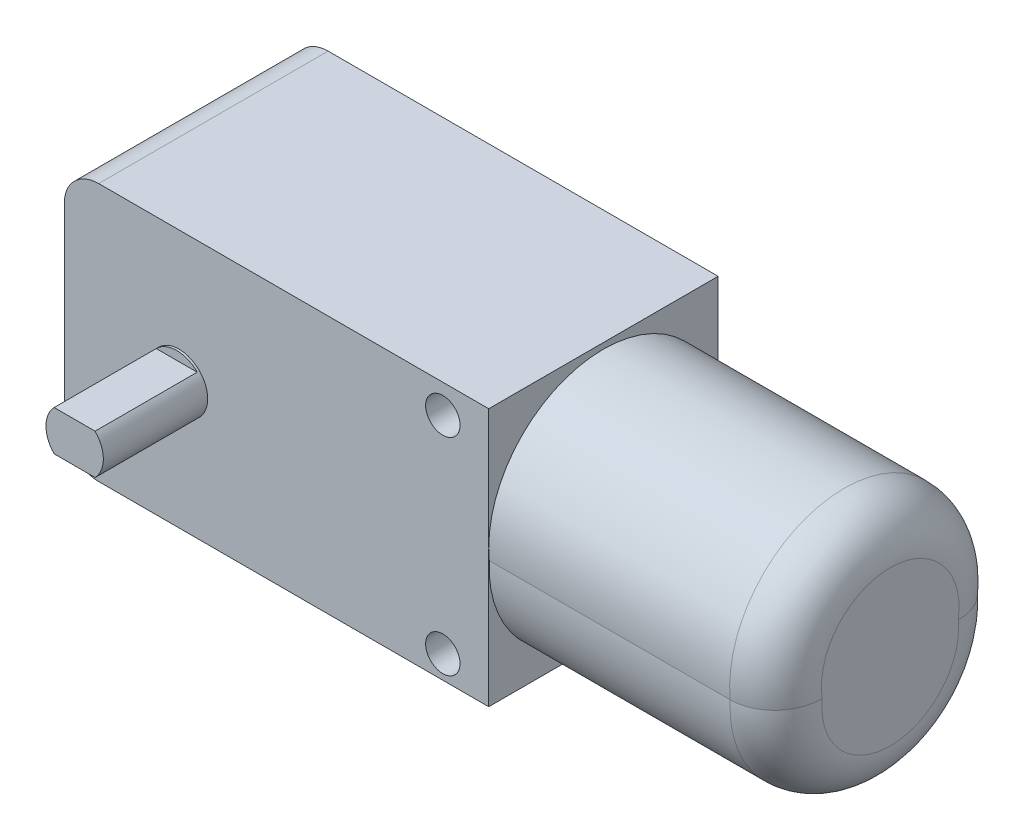
ISO-10303-21;
HEADER;
FILE_DESCRIPTION(('STEP AP214'),'2;1');
FILE_NAME('part.step','',(''),(''),'','','');
FILE_SCHEMA(('AUTOMOTIVE_DESIGN { 1 0 10303 214 1 1 1 1 }'));
ENDSEC;
DATA;
#1=APPLICATION_CONTEXT('core data for automotive mechanical design processes');
#2=APPLICATION_PROTOCOL_DEFINITION('international standard','automotive_design',2000,#1);
#3=PRODUCT_CONTEXT('',#1,'mechanical');
#4=PRODUCT('Part','Part','',(#3));
#5=PRODUCT_RELATED_PRODUCT_CATEGORY('part','',(#4));
#6=PRODUCT_DEFINITION_FORMATION('','',#4);
#7=PRODUCT_DEFINITION_CONTEXT('part definition',#1,'design');
#8=PRODUCT_DEFINITION('design','',#6,#7);
#9=PRODUCT_DEFINITION_SHAPE('','',#8);
#10=(LENGTH_UNIT() NAMED_UNIT(*) SI_UNIT(.MILLI.,.METRE.));
#11=(NAMED_UNIT(*) PLANE_ANGLE_UNIT() SI_UNIT($,.RADIAN.));
#12=(NAMED_UNIT(*) SI_UNIT($,.STERADIAN.) SOLID_ANGLE_UNIT());
#13=UNCERTAINTY_MEASURE_WITH_UNIT(LENGTH_MEASURE(1.E-05),#10,'distance_accuracy_value','');
#14=(GEOMETRIC_REPRESENTATION_CONTEXT(3) GLOBAL_UNCERTAINTY_ASSIGNED_CONTEXT((#13)) GLOBAL_UNIT_ASSIGNED_CONTEXT((#10,
#11,#12)) REPRESENTATION_CONTEXT('',''));
#15=CARTESIAN_POINT('',(0.,0.,0.));
#16=DIRECTION('',(0.,0.,1.));
#17=DIRECTION('',(1.,0.,0.));
#18=AXIS2_PLACEMENT_3D('',#15,#16,#17);
#19=CARTESIAN_POINT('',(-64.2641007815364,-2.5,-20.));
#20=DIRECTION('',(-1.,0.,0.));
#21=DIRECTION('',(0.,0.,1.));
#22=AXIS2_PLACEMENT_3D('',#19,#20,#21);
#23=PLANE('',#22);
#24=DIRECTION('',(0.,-1.,0.));
#25=VECTOR('',#24,1.);
#26=CARTESIAN_POINT('',(-64.2641007815364,-2.5,0.));
#27=LINE('',#26,#25);
#28=CARTESIAN_POINT('',(-64.2641007815364,-5.5,0.));
#29=VERTEX_POINT('',#28);
#30=CARTESIAN_POINT('',(-64.2641007815364,-22.,0.));
#31=VERTEX_POINT('',#30);
#32=EDGE_CURVE('E231',#29,#31,#27,.T.);
#33=ORIENTED_EDGE('',*,*,#32,.F.);
#34=DIRECTION('',(0.,0.,1.));
#35=VECTOR('',#34,1.);
#36=CARTESIAN_POINT('',(-64.2641007815364,-5.5,-20.));
#37=LINE('',#36,#35);
#38=CARTESIAN_POINT('',(-64.2641007815364,-5.5,-20.));
#39=VERTEX_POINT('',#38);
#40=EDGE_CURVE('E289',#29,#39,#37,.F.);
#41=ORIENTED_EDGE('',*,*,#40,.T.);
#42=DIRECTION('',(0.,-1.,0.));
#43=VECTOR('',#42,1.);
#44=CARTESIAN_POINT('',(-64.2641007815364,-2.5,-20.));
#45=LINE('',#44,#43);
#46=CARTESIAN_POINT('',(-64.2641007815364,-22.,-20.));
#47=VERTEX_POINT('',#46);
#48=EDGE_CURVE('E232',#39,#47,#45,.T.);
#49=ORIENTED_EDGE('',*,*,#48,.T.);
#50=DIRECTION('',(0.,0.,1.));
#51=VECTOR('',#50,1.);
#52=CARTESIAN_POINT('',(-64.2641007815364,-22.,-20.));
#53=LINE('',#52,#51);
#54=EDGE_CURVE('E285',#47,#31,#53,.T.);
#55=ORIENTED_EDGE('',*,*,#54,.T.);
#56=EDGE_LOOP('',(#33,#41,#49,#55));
#57=FACE_BOUND('',#56,.T.);
#58=DIRECTION('',(0.,0.,-1.));
#59=VECTOR('',#58,1.);
#60=CARTESIAN_POINT('',(-64.2641007815364,-11.25,-8.625));
#61=LINE('',#60,#59);
#62=CARTESIAN_POINT('',(-64.2641007815364,-11.25,-8.625));
#63=VERTEX_POINT('',#62);
#64=CARTESIAN_POINT('',(-64.2641007815364,-11.25,-11.375));
#65=VERTEX_POINT('',#64);
#66=EDGE_CURVE('E518',#63,#65,#61,.T.);
#67=ORIENTED_EDGE('',*,*,#66,.F.);
#68=DIRECTION('',(0.,1.,0.));
#69=VECTOR('',#68,1.);
#70=CARTESIAN_POINT('',(-64.2641007815364,-16.25,-8.625));
#71=LINE('',#70,#69);
#72=CARTESIAN_POINT('',(-64.2641007815364,-16.25,-8.625));
#73=VERTEX_POINT('',#72);
#74=EDGE_CURVE('E499',#73,#63,#71,.T.);
#75=ORIENTED_EDGE('',*,*,#74,.F.);
#76=DIRECTION('',(0.,0.,1.));
#77=VECTOR('',#76,1.);
#78=CARTESIAN_POINT('',(-64.2641007815364,-16.25,-8.625));
#79=LINE('',#78,#77);
#80=CARTESIAN_POINT('',(-64.2641007815364,-16.25,-11.375));
#81=VERTEX_POINT('',#80);
#82=EDGE_CURVE('E505',#81,#73,#79,.T.);
#83=ORIENTED_EDGE('',*,*,#82,.F.);
#84=DIRECTION('',(0.,-1.,0.));
#85=VECTOR('',#84,1.);
#86=CARTESIAN_POINT('',(-64.2641007815364,-16.25,-11.375));
#87=LINE('',#86,#85);
#88=EDGE_CURVE('E521',#65,#81,#87,.T.);
#89=ORIENTED_EDGE('',*,*,#88,.F.);
#90=EDGE_LOOP('',(#67,#75,#83,#89));
#91=FACE_BOUND('',#90,.T.);
#92=ADVANCED_FACE('F36',(#57,#91),#23,.T.);
#93=CARTESIAN_POINT('',(-27.2641007815364,-2.5,-20.));
#94=DIRECTION('',(1.,0.,0.));
#95=DIRECTION('',(0.,1.,0.));
#96=AXIS2_PLACEMENT_3D('',#93,#94,#95);
#97=PLANE('',#96);
#98=CARTESIAN_POINT('',(-27.2641007815364,-13.,-10.));
#99=DIRECTION('',(1.,0.,0.));
#100=DIRECTION('',(0.,1.,0.));
#101=AXIS2_PLACEMENT_3D('',#98,#99,#100);
#102=CIRCLE('',#101,10.);
#103=CARTESIAN_POINT('',(-27.2641007815364,-14.,-19.9498743710662));
#104=VERTEX_POINT('',#103);
#105=CARTESIAN_POINT('',(-27.2641007815364,-13.,-20.));
#106=VERTEX_POINT('',#105);
#107=EDGE_CURVE('E205',#104,#106,#102,.T.);
#108=ORIENTED_EDGE('',*,*,#107,.F.);
#109=CARTESIAN_POINT('',(-27.2641007815364,-14.5,-10.));
#110=DIRECTION('',(1.,0.,0.));
#111=DIRECTION('',(0.,1.,0.));
#112=AXIS2_PLACEMENT_3D('',#109,#110,#111);
#113=CIRCLE('',#112,9.96242942258564);
#114=CARTESIAN_POINT('',(-27.2641007815364,-14.,-0.050125628933799));
#115=VERTEX_POINT('',#114);
#116=EDGE_CURVE('E209',#115,#104,#113,.T.);
#117=ORIENTED_EDGE('',*,*,#116,.F.);
#118=CARTESIAN_POINT('',(-27.2641007815364,-13.,0.));
#119=VERTEX_POINT('',#118);
#120=EDGE_CURVE('E212',#119,#115,#102,.T.);
#121=ORIENTED_EDGE('',*,*,#120,.F.);
#122=DIRECTION('',(0.,1.,0.));
#123=VECTOR('',#122,1.);
#124=CARTESIAN_POINT('',(-27.2641007815364,-2.5,0.));
#125=LINE('',#124,#123);
#126=CARTESIAN_POINT('',(-27.2641007815364,-25.,0.));
#127=VERTEX_POINT('',#126);
#128=EDGE_CURVE('E257',#127,#119,#125,.T.);
#129=ORIENTED_EDGE('',*,*,#128,.F.);
#130=DIRECTION('',(0.,0.,1.));
#131=VECTOR('',#130,1.);
#132=CARTESIAN_POINT('',(-27.2641007815364,-25.,-20.));
#133=LINE('',#132,#131);
#134=CARTESIAN_POINT('',(-27.2641007815364,-25.,-20.));
#135=VERTEX_POINT('',#134);
#136=EDGE_CURVE('E249',#135,#127,#133,.T.);
#137=ORIENTED_EDGE('',*,*,#136,.F.);
#138=DIRECTION('',(0.,1.,0.));
#139=VECTOR('',#138,1.);
#140=CARTESIAN_POINT('',(-27.2641007815364,-2.5,-20.));
#141=LINE('',#140,#139);
#142=EDGE_CURVE('E241',#135,#106,#141,.T.);
#143=ORIENTED_EDGE('',*,*,#142,.T.);
#144=EDGE_LOOP('',(#108,#117,#121,#129,#137,#143));
#145=FACE_BOUND('',#144,.T.);
#146=ADVANCED_FACE('F346',(#145),#97,.T.);
#147=CARTESIAN_POINT('',(-64.2641007815364,-2.5,-20.));
#148=DIRECTION('',(0.,1.,0.));
#149=DIRECTION('',(0.,0.,1.));
#150=AXIS2_PLACEMENT_3D('',#147,#148,#149);
#151=PLANE('',#150);
#152=DIRECTION('',(-1.,0.,0.));
#153=VECTOR('',#152,1.);
#154=CARTESIAN_POINT('',(-64.2641007815364,-2.5,-20.));
#155=LINE('',#154,#153);
#156=CARTESIAN_POINT('',(-27.2641007815364,-2.5,-20.));
#157=VERTEX_POINT('',#156);
#158=CARTESIAN_POINT('',(-61.2641007815363,-2.5,-20.));
#159=VERTEX_POINT('',#158);
#160=EDGE_CURVE('E245',#157,#159,#155,.T.);
#161=ORIENTED_EDGE('',*,*,#160,.T.);
#162=DIRECTION('',(0.,0.,1.));
#163=VECTOR('',#162,1.);
#164=CARTESIAN_POINT('',(-61.2641007815363,-2.5,-20.));
#165=LINE('',#164,#163);
#166=CARTESIAN_POINT('',(-61.2641007815363,-2.5,0.));
#167=VERTEX_POINT('',#166);
#168=EDGE_CURVE('E275',#159,#167,#165,.T.);
#169=ORIENTED_EDGE('',*,*,#168,.T.);
#170=DIRECTION('',(-1.,0.,0.));
#171=VECTOR('',#170,1.);
#172=CARTESIAN_POINT('',(-64.2641007815364,-2.5,0.));
#173=LINE('',#172,#171);
#174=CARTESIAN_POINT('',(-27.2641007815364,-2.5,0.));
#175=VERTEX_POINT('',#174);
#176=EDGE_CURVE('E237',#175,#167,#173,.T.);
#177=ORIENTED_EDGE('',*,*,#176,.F.);
#178=DIRECTION('',(0.,0.,1.));
#179=VECTOR('',#178,1.);
#180=CARTESIAN_POINT('',(-27.2641007815364,-2.5,-20.));
#181=LINE('',#180,#179);
#182=EDGE_CURVE('E264',#157,#175,#181,.T.);
#183=ORIENTED_EDGE('',*,*,#182,.F.);
#184=EDGE_LOOP('',(#161,#169,#177,#183));
#185=FACE_BOUND('',#184,.T.);
#186=ADVANCED_FACE('F356',(#185),#151,.T.);
#187=EDGE_CURVE('E211',#106,#119,#102,.T.);
#188=ORIENTED_EDGE('',*,*,#187,.F.);
#189=EDGE_CURVE('E240',#106,#157,#141,.T.);
#190=ORIENTED_EDGE('',*,*,#189,.T.);
#191=ORIENTED_EDGE('',*,*,#182,.T.);
#192=EDGE_CURVE('E256',#119,#175,#125,.T.);
#193=ORIENTED_EDGE('',*,*,#192,.F.);
#194=EDGE_LOOP('',(#188,#190,#191,#193));
#195=FACE_BOUND('',#194,.T.);
#196=ADVANCED_FACE('F352',(#195),#97,.T.);
#197=CARTESIAN_POINT('',(-64.2641007815364,-25.,-20.));
#198=DIRECTION('',(0.,-1.,0.));
#199=DIRECTION('',(0.,0.,-1.));
#200=AXIS2_PLACEMENT_3D('',#197,#198,#199);
#201=PLANE('',#200);
#202=DIRECTION('',(1.,0.,0.));
#203=VECTOR('',#202,1.);
#204=CARTESIAN_POINT('',(-64.2641007815364,-25.,0.));
#205=LINE('',#204,#203);
#206=CARTESIAN_POINT('',(-61.2641007815363,-25.,0.));
#207=VERTEX_POINT('',#206);
#208=EDGE_CURVE('E253',#207,#127,#205,.T.);
#209=ORIENTED_EDGE('',*,*,#208,.F.);
#210=DIRECTION('',(0.,0.,1.));
#211=VECTOR('',#210,1.);
#212=CARTESIAN_POINT('',(-61.2641007815363,-25.,-20.));
#213=LINE('',#212,#211);
#214=CARTESIAN_POINT('',(-61.2641007815363,-25.,-20.));
#215=VERTEX_POINT('',#214);
#216=EDGE_CURVE('E297',#207,#215,#213,.F.);
#217=ORIENTED_EDGE('',*,*,#216,.T.);
#218=DIRECTION('',(1.,0.,0.));
#219=VECTOR('',#218,1.);
#220=CARTESIAN_POINT('',(-64.2641007815364,-25.,-20.));
#221=LINE('',#220,#219);
#222=EDGE_CURVE('E236',#215,#135,#221,.T.);
#223=ORIENTED_EDGE('',*,*,#222,.T.);
#224=ORIENTED_EDGE('',*,*,#136,.T.);
#225=EDGE_LOOP('',(#209,#217,#223,#224));
#226=FACE_BOUND('',#225,.T.);
#227=ADVANCED_FACE('F348',(#226),#201,.T.);
#228=CARTESIAN_POINT('',(0.,0.,-20.));
#229=DIRECTION('',(0.,0.,1.));
#230=DIRECTION('',(1.,0.,0.));
#231=AXIS2_PLACEMENT_3D('',#228,#229,#230);
#232=PLANE('',#231);
#233=CARTESIAN_POINT('',(-31.2641007815364,-23.,-20.));
#234=DIRECTION('',(0.,0.,-1.));
#235=DIRECTION('',(-1.,0.,0.));
#236=AXIS2_PLACEMENT_3D('',#233,#234,#235);
#237=CIRCLE('',#236,1.5);
#238=CARTESIAN_POINT('',(-32.7641007815364,-23.,-20.));
#239=VERTEX_POINT('',#238);
#240=EDGE_CURVE('E481',#239,#239,#237,.T.);
#241=ORIENTED_EDGE('',*,*,#240,.F.);
#242=EDGE_LOOP('',(#241));
#243=FACE_BOUND('',#242,.T.);
#244=CARTESIAN_POINT('',(-31.2641007815364,-4.99999999999999,-20.));
#245=DIRECTION('',(0.,0.,-1.));
#246=DIRECTION('',(-1.,0.,0.));
#247=AXIS2_PLACEMENT_3D('',#244,#245,#246);
#248=CIRCLE('',#247,1.5);
#249=CARTESIAN_POINT('',(-32.7641007815364,-4.99999999999999,-20.));
#250=VERTEX_POINT('',#249);
#251=EDGE_CURVE('E486',#250,#250,#248,.T.);
#252=ORIENTED_EDGE('',*,*,#251,.F.);
#253=EDGE_LOOP('',(#252));
#254=FACE_BOUND('',#253,.T.);
#255=CARTESIAN_POINT('',(-54.2641007815363,-14.,-20.));
#256=DIRECTION('',(0.,0.,1.));
#257=DIRECTION('',(1.,0.,0.));
#258=AXIS2_PLACEMENT_3D('',#255,#256,#257);
#259=CIRCLE('',#258,2.5);
#260=CARTESIAN_POINT('',(-51.7641007815363,-14.,-20.));
#261=VERTEX_POINT('',#260);
#262=EDGE_CURVE('E271',#261,#261,#259,.F.);
#263=ORIENTED_EDGE('',*,*,#262,.F.);
#264=EDGE_LOOP('',(#263));
#265=FACE_BOUND('',#264,.T.);
#266=ORIENTED_EDGE('',*,*,#48,.F.);
#267=CARTESIAN_POINT('',(-61.2641007815363,-5.5,-20.));
#268=DIRECTION('',(0.,0.,1.));
#269=DIRECTION('',(1.,0.,0.));
#270=AXIS2_PLACEMENT_3D('',#267,#268,#269);
#271=CIRCLE('',#270,3.);
#272=EDGE_CURVE('E294',#39,#159,#271,.F.);
#273=ORIENTED_EDGE('',*,*,#272,.T.);
#274=ORIENTED_EDGE('',*,*,#160,.F.);
#275=ORIENTED_EDGE('',*,*,#189,.F.);
#276=ORIENTED_EDGE('',*,*,#142,.F.);
#277=ORIENTED_EDGE('',*,*,#222,.F.);
#278=CARTESIAN_POINT('',(-61.2641007815363,-22.,-20.));
#279=DIRECTION('',(0.,0.,1.));
#280=DIRECTION('',(1.,0.,0.));
#281=AXIS2_PLACEMENT_3D('',#278,#279,#280);
#282=CIRCLE('',#281,3.);
#283=EDGE_CURVE('E292',#215,#47,#282,.F.);
#284=ORIENTED_EDGE('',*,*,#283,.T.);
#285=EDGE_LOOP('',(#266,#273,#274,#275,#276,#277,#284));
#286=FACE_BOUND('',#285,.T.);
#287=ADVANCED_FACE('F351',(#243,#254,#265,#286),#232,.F.);
#288=CARTESIAN_POINT('',(0.,0.,0.));
#289=DIRECTION('',(0.,0.,1.));
#290=DIRECTION('',(1.,0.,0.));
#291=AXIS2_PLACEMENT_3D('',#288,#289,#290);
#292=PLANE('',#291);
#293=CARTESIAN_POINT('',(-31.2641007815364,-23.,0.));
#294=DIRECTION('',(0.,0.,1.));
#295=DIRECTION('',(1.,0.,0.));
#296=AXIS2_PLACEMENT_3D('',#293,#294,#295);
#297=CIRCLE('',#296,1.5);
#298=CARTESIAN_POINT('',(-29.7641007815363,-23.,0.));
#299=VERTEX_POINT('',#298);
#300=EDGE_CURVE('E485',#299,#299,#297,.T.);
#301=ORIENTED_EDGE('',*,*,#300,.F.);
#302=EDGE_LOOP('',(#301));
#303=FACE_BOUND('',#302,.T.);
#304=CARTESIAN_POINT('',(-31.2641007815364,-4.99999999999999,0.));
#305=DIRECTION('',(0.,0.,1.));
#306=DIRECTION('',(1.,0.,0.));
#307=AXIS2_PLACEMENT_3D('',#304,#305,#306);
#308=CIRCLE('',#307,1.5);
#309=CARTESIAN_POINT('',(-29.7641007815364,-4.99999999999999,0.));
#310=VERTEX_POINT('',#309);
#311=EDGE_CURVE('E490',#310,#310,#308,.T.);
#312=ORIENTED_EDGE('',*,*,#311,.F.);
#313=EDGE_LOOP('',(#312));
#314=FACE_BOUND('',#313,.T.);
#315=CARTESIAN_POINT('',(-54.2641007815363,-14.,0.));
#316=DIRECTION('',(0.,0.,1.));
#317=DIRECTION('',(1.,0.,0.));
#318=AXIS2_PLACEMENT_3D('',#315,#316,#317);
#319=CIRCLE('',#318,2.5);
#320=CARTESIAN_POINT('',(-51.7641007815363,-14.,0.));
#321=VERTEX_POINT('',#320);
#322=EDGE_CURVE('E213',#321,#321,#319,.T.);
#323=ORIENTED_EDGE('',*,*,#322,.F.);
#324=EDGE_LOOP('',(#323));
#325=FACE_BOUND('',#324,.T.);
#326=ORIENTED_EDGE('',*,*,#176,.T.);
#327=CARTESIAN_POINT('',(-61.2641007815363,-5.5,0.));
#328=DIRECTION('',(0.,0.,1.));
#329=DIRECTION('',(1.,0.,0.));
#330=AXIS2_PLACEMENT_3D('',#327,#328,#329);
#331=CIRCLE('',#330,3.);
#332=EDGE_CURVE('E282',#167,#29,#331,.T.);
#333=ORIENTED_EDGE('',*,*,#332,.T.);
#334=ORIENTED_EDGE('',*,*,#32,.T.);
#335=CARTESIAN_POINT('',(-61.2641007815363,-22.,0.));
#336=DIRECTION('',(0.,0.,1.));
#337=DIRECTION('',(1.,0.,0.));
#338=AXIS2_PLACEMENT_3D('',#335,#336,#337);
#339=CIRCLE('',#338,3.);
#340=EDGE_CURVE('E279',#31,#207,#339,.T.);
#341=ORIENTED_EDGE('',*,*,#340,.T.);
#342=ORIENTED_EDGE('',*,*,#208,.T.);
#343=ORIENTED_EDGE('',*,*,#128,.T.);
#344=ORIENTED_EDGE('',*,*,#192,.T.);
#345=EDGE_LOOP('',(#326,#333,#334,#341,#342,#343,#344));
#346=FACE_BOUND('',#345,.T.);
#347=ADVANCED_FACE('F361',(#303,#314,#325,#346),#292,.T.);
#348=CARTESIAN_POINT('',(-2.26410078153636,-13.,-10.));
#349=DIRECTION('',(-1.,0.,0.));
#350=DIRECTION('',(0.,-1.,0.));
#351=AXIS2_PLACEMENT_3D('',#348,#349,#350);
#352=CYLINDRICAL_SURFACE('',#351,10.);
#353=DIRECTION('',(-1.,0.,0.));
#354=VECTOR('',#353,1.);
#355=CARTESIAN_POINT('',(-2.26410078153636,-14.,-0.050125628933799));
#356=LINE('',#355,#354);
#357=CARTESIAN_POINT('',(-6.26410078153636,-14.,-0.050125628933799));
#358=VERTEX_POINT('',#357);
#359=EDGE_CURVE('E228',#358,#115,#356,.T.);
#360=ORIENTED_EDGE('',*,*,#359,.F.);
#361=CARTESIAN_POINT('',(-6.26410078153636,-13.,-10.));
#362=DIRECTION('',(1.,0.,0.));
#363=DIRECTION('',(0.,1.,0.));
#364=AXIS2_PLACEMENT_3D('',#361,#362,#363);
#365=CIRCLE('',#364,10.);
#366=CARTESIAN_POINT('',(-6.26410078153636,-14.,-19.9498743710662));
#367=VERTEX_POINT('',#366);
#368=EDGE_CURVE('E307',#358,#367,#365,.F.);
#369=ORIENTED_EDGE('',*,*,#368,.T.);
#370=DIRECTION('',(-1.,0.,0.));
#371=VECTOR('',#370,1.);
#372=CARTESIAN_POINT('',(-2.26410078153636,-14.,-19.9498743710662));
#373=LINE('',#372,#371);
#374=EDGE_CURVE('E225',#367,#104,#373,.T.);
#375=ORIENTED_EDGE('',*,*,#374,.T.);
#376=ORIENTED_EDGE('',*,*,#107,.T.);
#377=ORIENTED_EDGE('',*,*,#187,.T.);
#378=ORIENTED_EDGE('',*,*,#120,.T.);
#379=EDGE_LOOP('',(#360,#369,#375,#376,#377,#378));
#380=FACE_BOUND('',#379,.T.);
#381=ADVANCED_FACE('F364',(#380),#352,.T.);
#382=CARTESIAN_POINT('',(-2.26410078153636,-14.5,-10.));
#383=DIRECTION('',(-1.,0.,0.));
#384=DIRECTION('',(0.,-1.,0.));
#385=AXIS2_PLACEMENT_3D('',#382,#383,#384);
#386=CYLINDRICAL_SURFACE('',#385,9.96242942258564);
#387=ORIENTED_EDGE('',*,*,#374,.F.);
#388=CARTESIAN_POINT('',(-6.26410078153636,-14.5,-10.));
#389=DIRECTION('',(1.,0.,0.));
#390=DIRECTION('',(0.,1.,0.));
#391=AXIS2_PLACEMENT_3D('',#388,#389,#390);
#392=CIRCLE('',#391,9.96242942258564);
#393=EDGE_CURVE('E311',#367,#358,#392,.F.);
#394=ORIENTED_EDGE('',*,*,#393,.T.);
#395=ORIENTED_EDGE('',*,*,#359,.T.);
#396=ORIENTED_EDGE('',*,*,#116,.T.);
#397=EDGE_LOOP('',(#387,#394,#395,#396));
#398=FACE_BOUND('',#397,.T.);
#399=ADVANCED_FACE('F371',(#398),#386,.T.);
#400=CARTESIAN_POINT('',(-2.26410078153636,-13.75,-10.));
#401=DIRECTION('',(1.,0.,0.));
#402=DIRECTION('',(0.,1.,0.));
#403=AXIS2_PLACEMENT_3D('',#400,#401,#402);
#404=PLANE('',#403);
#405=CARTESIAN_POINT('',(-2.26410078153636,-14.5,-10.));
#406=DIRECTION('',(1.,0.,0.));
#407=DIRECTION('',(0.,1.,0.));
#408=AXIS2_PLACEMENT_3D('',#405,#406,#407);
#409=CIRCLE('',#408,5.96242942258564);
#410=CARTESIAN_POINT('',(-2.26410078153636,-13.8998117935617,-4.06785546904264));
#411=VERTEX_POINT('',#410);
#412=CARTESIAN_POINT('',(-2.26410078153636,-13.8998117935617,-15.9321445309574));
#413=VERTEX_POINT('',#412);
#414=EDGE_CURVE('E300',#411,#413,#409,.T.);
#415=ORIENTED_EDGE('',*,*,#414,.T.);
#416=CARTESIAN_POINT('',(-2.26410078153636,-13.,-10.));
#417=DIRECTION('',(1.,0.,0.));
#418=DIRECTION('',(0.,1.,0.));
#419=AXIS2_PLACEMENT_3D('',#416,#417,#418);
#420=CIRCLE('',#419,6.00000000000001);
#421=EDGE_CURVE('E303',#413,#411,#420,.T.);
#422=ORIENTED_EDGE('',*,*,#421,.T.);
#423=EDGE_LOOP('',(#415,#422));
#424=FACE_BOUND('',#423,.T.);
#425=ADVANCED_FACE('F375',(#424),#404,.T.);
#426=CARTESIAN_POINT('',(-54.2641007815363,-14.,9.1));
#427=DIRECTION('',(0.,0.,-1.));
#428=DIRECTION('',(-1.,0.,0.));
#429=AXIS2_PLACEMENT_3D('',#426,#427,#428);
#430=CYLINDRICAL_SURFACE('',#429,2.5);
#431=CARTESIAN_POINT('',(-54.2641007815363,-14.,9.1));
#432=DIRECTION('',(0.,0.,1.));
#433=DIRECTION('',(1.,0.,0.));
#434=AXIS2_PLACEMENT_3D('',#431,#432,#433);
#435=CIRCLE('',#434,2.5);
#436=CARTESIAN_POINT('',(-56.0494578886721,-12.25,9.1));
#437=VERTEX_POINT('',#436);
#438=CARTESIAN_POINT('',(-56.0494578886721,-15.75,9.1));
#439=VERTEX_POINT('',#438);
#440=EDGE_CURVE('E201',#437,#439,#435,.T.);
#441=ORIENTED_EDGE('',*,*,#440,.F.);
#442=DIRECTION('',(0.,0.,-1.));
#443=VECTOR('',#442,1.);
#444=CARTESIAN_POINT('',(-56.0494578886721,-12.25,9.1));
#445=LINE('',#444,#443);
#446=CARTESIAN_POINT('',(-56.0494578886721,-12.25,0.200000000000001));
#447=VERTEX_POINT('',#446);
#448=EDGE_CURVE('E60',#437,#447,#445,.T.);
#449=ORIENTED_EDGE('',*,*,#448,.T.);
#450=CARTESIAN_POINT('',(-54.2641007815363,-14.,0.200000000000001));
#451=DIRECTION('',(0.,0.,1.));
#452=DIRECTION('',(1.,0.,0.));
#453=AXIS2_PLACEMENT_3D('',#450,#451,#452);
#454=CIRCLE('',#453,2.5);
#455=CARTESIAN_POINT('',(-52.4787436744006,-12.25,0.200000000000001));
#456=VERTEX_POINT('',#455);
#457=EDGE_CURVE('E11',#456,#447,#454,.T.);
#458=ORIENTED_EDGE('',*,*,#457,.F.);
#459=DIRECTION('',(0.,0.,-1.));
#460=VECTOR('',#459,1.);
#461=CARTESIAN_POINT('',(-52.4787436744006,-12.25,9.1));
#462=LINE('',#461,#460);
#463=CARTESIAN_POINT('',(-52.4787436744006,-12.25,9.1));
#464=VERTEX_POINT('',#463);
#465=EDGE_CURVE('E456',#456,#464,#462,.F.);
#466=ORIENTED_EDGE('',*,*,#465,.T.);
#467=CARTESIAN_POINT('',(-52.4787436744006,-15.75,9.1));
#468=VERTEX_POINT('',#467);
#469=EDGE_CURVE('E206',#468,#464,#435,.T.);
#470=ORIENTED_EDGE('',*,*,#469,.F.);
#471=DIRECTION('',(0.,0.,-1.));
#472=VECTOR('',#471,1.);
#473=CARTESIAN_POINT('',(-52.4787436744006,-15.75,9.1));
#474=LINE('',#473,#472);
#475=CARTESIAN_POINT('',(-52.4787436744006,-15.75,0.200000000000001));
#476=VERTEX_POINT('',#475);
#477=EDGE_CURVE('E52',#468,#476,#474,.T.);
#478=ORIENTED_EDGE('',*,*,#477,.T.);
#479=CARTESIAN_POINT('',(-54.2641007815363,-14.,0.200000000000001));
#480=DIRECTION('',(0.,0.,1.));
#481=DIRECTION('',(1.,0.,0.));
#482=AXIS2_PLACEMENT_3D('',#479,#480,#481);
#483=CIRCLE('',#482,2.5);
#484=CARTESIAN_POINT('',(-56.0494578886721,-15.75,0.200000000000001));
#485=VERTEX_POINT('',#484);
#486=EDGE_CURVE('E45',#485,#476,#483,.T.);
#487=ORIENTED_EDGE('',*,*,#486,.F.);
#488=DIRECTION('',(0.,0.,-1.));
#489=VECTOR('',#488,1.);
#490=CARTESIAN_POINT('',(-56.0494578886721,-15.75,9.1));
#491=LINE('',#490,#489);
#492=EDGE_CURVE('E187',#485,#439,#491,.F.);
#493=ORIENTED_EDGE('',*,*,#492,.T.);
#494=EDGE_LOOP('',(#441,#449,#458,#466,#470,#478,#487,#493));
#495=FACE_BOUND('',#494,.T.);
#496=ORIENTED_EDGE('',*,*,#322,.T.);
#497=EDGE_LOOP('',(#496));
#498=FACE_BOUND('',#497,.T.);
#499=ADVANCED_FACE('F199',(#495,#498),#430,.T.);
#500=CARTESIAN_POINT('',(-54.2641007815363,-14.,9.1));
#501=DIRECTION('',(0.,0.,1.));
#502=DIRECTION('',(1.,0.,0.));
#503=AXIS2_PLACEMENT_3D('',#500,#501,#502);
#504=PLANE('',#503);
#505=DIRECTION('',(1.,0.,0.));
#506=VECTOR('',#505,1.);
#507=CARTESIAN_POINT('',(-54.2641007815363,-12.25,9.1));
#508=LINE('',#507,#506);
#509=EDGE_CURVE('E193',#437,#464,#508,.T.);
#510=ORIENTED_EDGE('',*,*,#509,.F.);
#511=ORIENTED_EDGE('',*,*,#440,.T.);
#512=DIRECTION('',(-1.,0.,0.));
#513=VECTOR('',#512,1.);
#514=CARTESIAN_POINT('',(-54.2641007815363,-15.75,9.1));
#515=LINE('',#514,#513);
#516=EDGE_CURVE('E184',#468,#439,#515,.T.);
#517=ORIENTED_EDGE('',*,*,#516,.F.);
#518=ORIENTED_EDGE('',*,*,#469,.T.);
#519=EDGE_LOOP('',(#510,#511,#517,#518));
#520=FACE_BOUND('',#519,.T.);
#521=ADVANCED_FACE('F204',(#520),#504,.T.);
#522=CARTESIAN_POINT('',(-54.2641007815363,-14.,-29.1));
#523=DIRECTION('',(0.,0.,1.));
#524=DIRECTION('',(1.,0.,0.));
#525=AXIS2_PLACEMENT_3D('',#522,#523,#524);
#526=CYLINDRICAL_SURFACE('',#525,2.5);
#527=CARTESIAN_POINT('',(-54.2641007815363,-14.,-29.1));
#528=DIRECTION('',(0.,0.,-1.));
#529=DIRECTION('',(-1.,0.,0.));
#530=AXIS2_PLACEMENT_3D('',#527,#528,#529);
#531=CIRCLE('',#530,2.5);
#532=CARTESIAN_POINT('',(-56.0494578886721,-15.75,-29.1));
#533=VERTEX_POINT('',#532);
#534=CARTESIAN_POINT('',(-56.0494578886721,-12.25,-29.1));
#535=VERTEX_POINT('',#534);
#536=EDGE_CURVE('E216',#533,#535,#531,.T.);
#537=ORIENTED_EDGE('',*,*,#536,.F.);
#538=DIRECTION('',(0.,0.,1.));
#539=VECTOR('',#538,1.);
#540=CARTESIAN_POINT('',(-56.0494578886721,-15.75,-29.1));
#541=LINE('',#540,#539);
#542=CARTESIAN_POINT('',(-56.0494578886721,-15.75,-20.2));
#543=VERTEX_POINT('',#542);
#544=EDGE_CURVE('E478',#533,#543,#541,.T.);
#545=ORIENTED_EDGE('',*,*,#544,.T.);
#546=CARTESIAN_POINT('',(-54.2641007815363,-14.,-20.2));
#547=DIRECTION('',(0.,0.,-1.));
#548=DIRECTION('',(-1.,0.,0.));
#549=AXIS2_PLACEMENT_3D('',#546,#547,#548);
#550=CIRCLE('',#549,2.5);
#551=CARTESIAN_POINT('',(-52.4787436744006,-15.75,-20.2));
#552=VERTEX_POINT('',#551);
#553=EDGE_CURVE('E194',#552,#543,#550,.T.);
#554=ORIENTED_EDGE('',*,*,#553,.F.);
#555=DIRECTION('',(0.,0.,1.));
#556=VECTOR('',#555,1.);
#557=CARTESIAN_POINT('',(-52.4787436744006,-15.75,-29.1));
#558=LINE('',#557,#556);
#559=CARTESIAN_POINT('',(-52.4787436744006,-15.75,-29.1));
#560=VERTEX_POINT('',#559);
#561=EDGE_CURVE('E475',#552,#560,#558,.F.);
#562=ORIENTED_EDGE('',*,*,#561,.T.);
#563=CARTESIAN_POINT('',(-52.4787436744006,-12.25,-29.1));
#564=VERTEX_POINT('',#563);
#565=EDGE_CURVE('E220',#564,#560,#531,.T.);
#566=ORIENTED_EDGE('',*,*,#565,.F.);
#567=DIRECTION('',(0.,0.,1.));
#568=VECTOR('',#567,1.);
#569=CARTESIAN_POINT('',(-52.4787436744006,-12.25,-29.1));
#570=LINE('',#569,#568);
#571=CARTESIAN_POINT('',(-52.4787436744006,-12.25,-20.2));
#572=VERTEX_POINT('',#571);
#573=EDGE_CURVE('E472',#564,#572,#570,.T.);
#574=ORIENTED_EDGE('',*,*,#573,.T.);
#575=CARTESIAN_POINT('',(-54.2641007815363,-14.,-20.2));
#576=DIRECTION('',(0.,0.,1.));
#577=DIRECTION('',(1.,0.,0.));
#578=AXIS2_PLACEMENT_3D('',#575,#576,#577);
#579=CIRCLE('',#578,2.5);
#580=CARTESIAN_POINT('',(-56.0494578886721,-12.25,-20.2));
#581=VERTEX_POINT('',#580);
#582=EDGE_CURVE('E900',#572,#581,#579,.T.);
#583=ORIENTED_EDGE('',*,*,#582,.T.);
#584=DIRECTION('',(0.,0.,1.));
#585=VECTOR('',#584,1.);
#586=CARTESIAN_POINT('',(-56.0494578886721,-12.25,-29.1));
#587=LINE('',#586,#585);
#588=EDGE_CURVE('E468',#581,#535,#587,.F.);
#589=ORIENTED_EDGE('',*,*,#588,.T.);
#590=EDGE_LOOP('',(#537,#545,#554,#562,#566,#574,#583,#589));
#591=FACE_BOUND('',#590,.T.);
#592=ORIENTED_EDGE('',*,*,#262,.T.);
#593=EDGE_LOOP('',(#592));
#594=FACE_BOUND('',#593,.T.);
#595=ADVANCED_FACE('F384',(#591,#594),#526,.T.);
#596=CARTESIAN_POINT('',(-54.2641007815363,-14.,-29.1));
#597=DIRECTION('',(0.,0.,-1.));
#598=DIRECTION('',(-1.,0.,0.));
#599=AXIS2_PLACEMENT_3D('',#596,#597,#598);
#600=PLANE('',#599);
#601=DIRECTION('',(1.,0.,0.));
#602=VECTOR('',#601,1.);
#603=CARTESIAN_POINT('',(-54.2641007815363,-15.75,-29.1));
#604=LINE('',#603,#602);
#605=EDGE_CURVE('E895',#533,#560,#604,.T.);
#606=ORIENTED_EDGE('',*,*,#605,.F.);
#607=ORIENTED_EDGE('',*,*,#536,.T.);
#608=DIRECTION('',(-1.,0.,0.));
#609=VECTOR('',#608,1.);
#610=CARTESIAN_POINT('',(-54.2641007815363,-12.25,-29.1));
#611=LINE('',#610,#609);
#612=EDGE_CURVE('E314',#564,#535,#611,.T.);
#613=ORIENTED_EDGE('',*,*,#612,.F.);
#614=ORIENTED_EDGE('',*,*,#565,.T.);
#615=EDGE_LOOP('',(#606,#607,#613,#614));
#616=FACE_BOUND('',#615,.T.);
#617=ADVANCED_FACE('F342',(#616),#600,.T.);
#618=CARTESIAN_POINT('',(-61.2641007815363,-5.5,-20.));
#619=DIRECTION('',(0.,0.,1.));
#620=DIRECTION('',(1.,0.,0.));
#621=AXIS2_PLACEMENT_3D('',#618,#619,#620);
#622=CYLINDRICAL_SURFACE('',#621,3.);
#623=ORIENTED_EDGE('',*,*,#272,.F.);
#624=ORIENTED_EDGE('',*,*,#40,.F.);
#625=ORIENTED_EDGE('',*,*,#332,.F.);
#626=ORIENTED_EDGE('',*,*,#168,.F.);
#627=EDGE_LOOP('',(#623,#624,#625,#626));
#628=FACE_BOUND('',#627,.T.);
#629=ADVANCED_FACE('F338',(#628),#622,.T.);
#630=CARTESIAN_POINT('',(-61.2641007815363,-22.,-20.));
#631=DIRECTION('',(0.,0.,1.));
#632=DIRECTION('',(1.,0.,0.));
#633=AXIS2_PLACEMENT_3D('',#630,#631,#632);
#634=CYLINDRICAL_SURFACE('',#633,3.);
#635=ORIENTED_EDGE('',*,*,#283,.F.);
#636=ORIENTED_EDGE('',*,*,#216,.F.);
#637=ORIENTED_EDGE('',*,*,#340,.F.);
#638=ORIENTED_EDGE('',*,*,#54,.F.);
#639=EDGE_LOOP('',(#635,#636,#637,#638));
#640=FACE_BOUND('',#639,.T.);
#641=ADVANCED_FACE('F333',(#640),#634,.T.);
#642=CARTESIAN_POINT('',(-6.26410078153636,-14.5,-10.));
#643=DIRECTION('',(1.,0.,0.));
#644=DIRECTION('',(0.,1.,0.));
#645=AXIS2_PLACEMENT_3D('',#642,#643,#644);
#646=TOROIDAL_SURFACE('',#645,5.96242942258564,4.);
#647=CARTESIAN_POINT('',(-6.26410078153636,-14.,-0.0501256289337972));
#648=CARTESIAN_POINT('',(-6.15185902546831,-14.000000274041,-0.0501147425256198));
#649=CARTESIAN_POINT('',(-6.03962243514195,-13.9998816706764,-0.0548618209978833));
#650=CARTESIAN_POINT('',(-5.815953370965,-13.9994088280504,-0.0737876869232872));
#651=CARTESIAN_POINT('',(-5.70452085610091,-13.9990546008945,-0.0879659898306335));
#652=CARTESIAN_POINT('',(-5.48332479571403,-13.9981129815083,-0.125655997962684));
#653=CARTESIAN_POINT('',(-5.3735600640966,-13.9975257638918,-0.149160713542755));
#654=CARTESIAN_POINT('',(-5.15642855298614,-13.9961230023291,-0.20531106937798));
#655=CARTESIAN_POINT('',(-5.04906174581178,-13.99530746102,-0.237956604053743));
#656=CARTESIAN_POINT('',(-4.73159871379289,-13.9925251282304,-0.349335479338677));
#657=CARTESIAN_POINT('',(-4.52604457629031,-13.9902222198653,-0.441527420558998));
#658=CARTESIAN_POINT('',(-4.13347860753174,-13.9847903439029,-0.659007607916585));
#659=CARTESIAN_POINT('',(-3.94646280497822,-13.9816615537551,-0.784288744495021));
#660=CARTESIAN_POINT('',(-3.59589185790122,-13.9746639843926,-1.06452948481339));
#661=CARTESIAN_POINT('',(-3.43235672688429,-13.9707945803996,-1.21951414645238));
#662=CARTESIAN_POINT('',(-3.13351486852415,-13.962427785588,-1.55471533493232));
#663=CARTESIAN_POINT('',(-2.99821659172907,-13.9579302074436,-1.7349393883715));
#664=CARTESIAN_POINT('',(-2.75931111989228,-13.9484243188543,-2.11597355100318));
#665=CARTESIAN_POINT('',(-2.65579536140018,-13.9434145890847,-2.31684087743359));
#666=CARTESIAN_POINT('',(-2.48386016474512,-13.9330401401763,-2.73298703883004));
#667=CARTESIAN_POINT('',(-2.41541665101331,-13.9276756674168,-2.94825587271769));
#668=CARTESIAN_POINT('',(-2.33262323572276,-13.9186388626452,-3.31110103393218));
#669=CARTESIAN_POINT('',(-2.3077552029003,-13.9150219314222,-3.45638142459727));
#670=CARTESIAN_POINT('',(-2.27400606240202,-13.9077493433409,-3.748634106835));
#671=CARTESIAN_POINT('',(-2.26509821963306,-13.9040937615814,-3.8956031532046));
#672=CARTESIAN_POINT('',(-2.26412709770861,-13.9002319599955,-4.05095251654191));
#673=CARTESIAN_POINT('',(-2.26410071169739,-13.9000218678504,-4.05940421007925));
#674=CARTESIAN_POINT('',(-2.26410078153636,-13.8998117935617,-4.06785546904264));
#675=B_SPLINE_CURVE_WITH_KNOTS('',3,(#647,#648,#649,#650,#651,#652,#653,#654,#655,#656,#657,
#658,#659,#660,#661,#662,#663,#664,#665,#666,#667,#668,#669,#670,#671,#672,#673,#674),
.UNSPECIFIED.,.F.,.F.,(4,2,2,2,2,2,2,2,2,2,2,2,2,4),(0.,0.336615555791165,0.673213818699897,
1.00956029434609,1.34590288524294,2.01830164594818,2.69055605212652,3.36338008855914,
4.03640519570355,4.71134879771961,5.38582845757267,5.82738358676229,6.26819836802391,
6.29356120706971),.UNSPECIFIED.);
#676=EDGE_CURVE('E315',#358,#411,#675,.T.);
#677=ORIENTED_EDGE('',*,*,#676,.F.);
#678=ORIENTED_EDGE('',*,*,#393,.F.);
#679=CARTESIAN_POINT('',(-6.26410078153636,-14.,-19.9498743710662));
#680=CARTESIAN_POINT('',(-6.15185902546831,-14.000000274041,-19.9498852574744));
#681=CARTESIAN_POINT('',(-6.03962243514195,-13.9998816706764,-19.9451381790021));
#682=CARTESIAN_POINT('',(-5.815953370965,-13.9994088280504,-19.9262123130767));
#683=CARTESIAN_POINT('',(-5.70452085610091,-13.9990546008945,-19.9120340101694));
#684=CARTESIAN_POINT('',(-5.48332479571402,-13.9981129815083,-19.8743440020373));
#685=CARTESIAN_POINT('',(-5.3735600640966,-13.9975257638918,-19.8508392864572));
#686=CARTESIAN_POINT('',(-5.15642855298614,-13.996123002329,-19.794688930622));
#687=CARTESIAN_POINT('',(-5.04906174581178,-13.99530746102,-19.7620433959463));
#688=CARTESIAN_POINT('',(-4.73159871379289,-13.9925251282304,-19.6506645206613));
#689=CARTESIAN_POINT('',(-4.52604457629031,-13.9902222198653,-19.558472579441));
#690=CARTESIAN_POINT('',(-4.13347860753174,-13.9847903439029,-19.3409923920834));
#691=CARTESIAN_POINT('',(-3.94646280497822,-13.981661553755,-19.215711255505));
#692=CARTESIAN_POINT('',(-3.59589185790122,-13.9746639843926,-18.9354705151866));
#693=CARTESIAN_POINT('',(-3.43235672688429,-13.9707945803996,-18.7804858535476));
#694=CARTESIAN_POINT('',(-3.13351486852415,-13.962427785588,-18.4452846650677));
#695=CARTESIAN_POINT('',(-2.99821659172907,-13.9579302074436,-18.2650606116285));
#696=CARTESIAN_POINT('',(-2.75931111989228,-13.9484243188542,-17.8840264489968));
#697=CARTESIAN_POINT('',(-2.65579536140018,-13.9434145890847,-17.6831591225664));
#698=CARTESIAN_POINT('',(-2.48386016474512,-13.9330401401763,-17.26701296117));
#699=CARTESIAN_POINT('',(-2.41541665101331,-13.9276756674168,-17.0517441272823));
#700=CARTESIAN_POINT('',(-2.33262323572276,-13.9186388626452,-16.6888989660678));
#701=CARTESIAN_POINT('',(-2.3077552029003,-13.9150219314221,-16.5436185754027));
#702=CARTESIAN_POINT('',(-2.27400606240202,-13.9077493433409,-16.251365893165));
#703=CARTESIAN_POINT('',(-2.26509821963306,-13.9040937615815,-16.1043968467954));
#704=CARTESIAN_POINT('',(-2.26412709770861,-13.9002319599955,-15.9490474834581));
#705=CARTESIAN_POINT('',(-2.26410071169739,-13.9000218678504,-15.9405957899207));
#706=CARTESIAN_POINT('',(-2.26410078153636,-13.8998117935617,-15.9321445309574));
#707=B_SPLINE_CURVE_WITH_KNOTS('',3,(#679,#680,#681,#682,#683,#684,#685,#686,#687,#688,#689,
#690,#691,#692,#693,#694,#695,#696,#697,#698,#699,#700,#701,#702,#703,#704,#705,#706),
.UNSPECIFIED.,.F.,.F.,(4,2,2,2,2,2,2,2,2,2,2,2,2,4),(0.,0.336615555791165,0.673213818699898,
1.00956029434609,1.34590288524294,2.01830164594818,2.69055605212653,3.36338008855914,
4.03640519570354,4.71134879771961,5.38582845757268,5.82738358676229,6.26819836802391,
6.2935612070697),.UNSPECIFIED.);
#708=EDGE_CURVE('E322',#413,#367,#707,.F.);
#709=ORIENTED_EDGE('',*,*,#708,.F.);
#710=ORIENTED_EDGE('',*,*,#414,.F.);
#711=EDGE_LOOP('',(#677,#678,#709,#710));
#712=FACE_BOUND('',#711,.T.);
#713=ADVANCED_FACE('F329',(#712),#646,.T.);
#714=CARTESIAN_POINT('',(-6.26410078153636,-13.,-10.));
#715=DIRECTION('',(1.,0.,0.));
#716=DIRECTION('',(0.,1.,0.));
#717=AXIS2_PLACEMENT_3D('',#714,#715,#716);
#718=TOROIDAL_SURFACE('',#717,6.00000000000001,4.);
#719=ORIENTED_EDGE('',*,*,#708,.T.);
#720=ORIENTED_EDGE('',*,*,#368,.F.);
#721=ORIENTED_EDGE('',*,*,#676,.T.);
#722=ORIENTED_EDGE('',*,*,#421,.F.);
#723=EDGE_LOOP('',(#719,#720,#721,#722));
#724=FACE_BOUND('',#723,.T.);
#725=ADVANCED_FACE('F38',(#724),#718,.T.);
#726=CARTESIAN_POINT('',(-69.2641007815364,-16.25,-8.625));
#727=DIRECTION('',(0.,0.,-1.));
#728=DIRECTION('',(0.,1.,0.));
#729=AXIS2_PLACEMENT_3D('',#726,#727,#728);
#730=PLANE('',#729);
#731=CARTESIAN_POINT('',(-66.7641007815364,-13.75,-8.625));
#732=DIRECTION('',(0.,0.,-1.));
#733=DIRECTION('',(0.,1.,0.));
#734=AXIS2_PLACEMENT_3D('',#731,#732,#733);
#735=CIRCLE('',#734,1.5);
#736=CARTESIAN_POINT('',(-66.7641007815364,-12.25,-8.625));
#737=VERTEX_POINT('',#736);
#738=EDGE_CURVE('E495',#737,#737,#735,.F.);
#739=ORIENTED_EDGE('',*,*,#738,.F.);
#740=EDGE_LOOP('',(#739));
#741=FACE_BOUND('',#740,.T.);
#742=ORIENTED_EDGE('',*,*,#74,.T.);
#743=DIRECTION('',(1.,0.,0.));
#744=VECTOR('',#743,1.);
#745=CARTESIAN_POINT('',(-69.2641007815364,-11.25,-8.625));
#746=LINE('',#745,#744);
#747=CARTESIAN_POINT('',(-69.2641007815364,-11.25,-8.625));
#748=VERTEX_POINT('',#747);
#749=EDGE_CURVE('E323',#748,#63,#746,.T.);
#750=ORIENTED_EDGE('',*,*,#749,.F.);
#751=DIRECTION('',(0.,1.,0.));
#752=VECTOR('',#751,1.);
#753=CARTESIAN_POINT('',(-69.2641007815364,-16.25,-8.625));
#754=LINE('',#753,#752);
#755=CARTESIAN_POINT('',(-69.2641007815364,-16.25,-8.625));
#756=VERTEX_POINT('',#755);
#757=EDGE_CURVE('E500',#756,#748,#754,.T.);
#758=ORIENTED_EDGE('',*,*,#757,.F.);
#759=DIRECTION('',(1.,0.,0.));
#760=VECTOR('',#759,1.);
#761=CARTESIAN_POINT('',(-69.2641007815364,-16.25,-8.625));
#762=LINE('',#761,#760);
#763=EDGE_CURVE('E514',#756,#73,#762,.T.);
#764=ORIENTED_EDGE('',*,*,#763,.T.);
#765=EDGE_LOOP('',(#742,#750,#758,#764));
#766=FACE_BOUND('',#765,.T.);
#767=ADVANCED_FACE('F391',(#741,#766),#730,.F.);
#768=CARTESIAN_POINT('',(-69.2641007815364,-11.25,-8.625));
#769=DIRECTION('',(0.,-1.,0.));
#770=DIRECTION('',(0.,0.,-1.));
#771=AXIS2_PLACEMENT_3D('',#768,#769,#770);
#772=PLANE('',#771);
#773=ORIENTED_EDGE('',*,*,#66,.T.);
#774=DIRECTION('',(1.,0.,0.));
#775=VECTOR('',#774,1.);
#776=CARTESIAN_POINT('',(-69.2641007815364,-11.25,-11.375));
#777=LINE('',#776,#775);
#778=CARTESIAN_POINT('',(-69.2641007815364,-11.25,-11.375));
#779=VERTEX_POINT('',#778);
#780=EDGE_CURVE('E533',#779,#65,#777,.T.);
#781=ORIENTED_EDGE('',*,*,#780,.F.);
#782=DIRECTION('',(0.,0.,-1.));
#783=VECTOR('',#782,1.);
#784=CARTESIAN_POINT('',(-69.2641007815364,-11.25,-8.625));
#785=LINE('',#784,#783);
#786=EDGE_CURVE('E504',#748,#779,#785,.T.);
#787=ORIENTED_EDGE('',*,*,#786,.F.);
#788=ORIENTED_EDGE('',*,*,#749,.T.);
#789=EDGE_LOOP('',(#773,#781,#787,#788));
#790=FACE_BOUND('',#789,.T.);
#791=ADVANCED_FACE('F394',(#790),#772,.F.);
#792=CARTESIAN_POINT('',(-69.2641007815364,-16.25,-11.375));
#793=DIRECTION('',(0.,0.,1.));
#794=DIRECTION('',(1.,0.,0.));
#795=AXIS2_PLACEMENT_3D('',#792,#793,#794);
#796=PLANE('',#795);
#797=CARTESIAN_POINT('',(-66.7641007815364,-13.75,-11.375));
#798=DIRECTION('',(0.,0.,-1.));
#799=DIRECTION('',(-1.,0.,0.));
#800=AXIS2_PLACEMENT_3D('',#797,#798,#799);
#801=CIRCLE('',#800,1.5);
#802=CARTESIAN_POINT('',(-68.2641007815364,-13.75,-11.375));
#803=VERTEX_POINT('',#802);
#804=EDGE_CURVE('E491',#803,#803,#801,.T.);
#805=ORIENTED_EDGE('',*,*,#804,.F.);
#806=EDGE_LOOP('',(#805));
#807=FACE_BOUND('',#806,.T.);
#808=ORIENTED_EDGE('',*,*,#88,.T.);
#809=DIRECTION('',(1.,0.,0.));
#810=VECTOR('',#809,1.);
#811=CARTESIAN_POINT('',(-69.2641007815364,-16.25,-11.375));
#812=LINE('',#811,#810);
#813=CARTESIAN_POINT('',(-69.2641007815364,-16.25,-11.375));
#814=VERTEX_POINT('',#813);
#815=EDGE_CURVE('E530',#814,#81,#812,.T.);
#816=ORIENTED_EDGE('',*,*,#815,.F.);
#817=DIRECTION('',(0.,-1.,0.));
#818=VECTOR('',#817,1.);
#819=CARTESIAN_POINT('',(-69.2641007815364,-16.25,-11.375));
#820=LINE('',#819,#818);
#821=EDGE_CURVE('E508',#779,#814,#820,.T.);
#822=ORIENTED_EDGE('',*,*,#821,.F.);
#823=ORIENTED_EDGE('',*,*,#780,.T.);
#824=EDGE_LOOP('',(#808,#816,#822,#823));
#825=FACE_BOUND('',#824,.T.);
#826=ADVANCED_FACE('F398',(#807,#825),#796,.F.);
#827=CARTESIAN_POINT('',(-69.2641007815364,-16.25,-8.625));
#828=DIRECTION('',(0.,1.,0.));
#829=DIRECTION('',(0.,0.,1.));
#830=AXIS2_PLACEMENT_3D('',#827,#828,#829);
#831=PLANE('',#830);
#832=ORIENTED_EDGE('',*,*,#82,.T.);
#833=ORIENTED_EDGE('',*,*,#763,.F.);
#834=DIRECTION('',(0.,0.,1.));
#835=VECTOR('',#834,1.);
#836=CARTESIAN_POINT('',(-69.2641007815364,-16.25,-8.625));
#837=LINE('',#836,#835);
#838=EDGE_CURVE('E511',#814,#756,#837,.T.);
#839=ORIENTED_EDGE('',*,*,#838,.F.);
#840=ORIENTED_EDGE('',*,*,#815,.T.);
#841=EDGE_LOOP('',(#832,#833,#839,#840));
#842=FACE_BOUND('',#841,.T.);
#843=ADVANCED_FACE('F402',(#842),#831,.F.);
#844=CARTESIAN_POINT('',(-69.2641007815364,0.,0.));
#845=DIRECTION('',(-1.,0.,0.));
#846=DIRECTION('',(0.,0.,1.));
#847=AXIS2_PLACEMENT_3D('',#844,#845,#846);
#848=PLANE('',#847);
#849=ORIENTED_EDGE('',*,*,#757,.T.);
#850=ORIENTED_EDGE('',*,*,#786,.T.);
#851=ORIENTED_EDGE('',*,*,#821,.T.);
#852=ORIENTED_EDGE('',*,*,#838,.T.);
#853=EDGE_LOOP('',(#849,#850,#851,#852));
#854=FACE_BOUND('',#853,.T.);
#855=ADVANCED_FACE('F406',(#854),#848,.T.);
#856=CARTESIAN_POINT('',(-66.7641007815364,-13.75,-4.38235931288072));
#857=DIRECTION('',(0.,0.,-1.));
#858=DIRECTION('',(-1.,0.,0.));
#859=AXIS2_PLACEMENT_3D('',#856,#857,#858);
#860=CYLINDRICAL_SURFACE('',#859,1.5);
#861=ORIENTED_EDGE('',*,*,#738,.T.);
#862=EDGE_LOOP('',(#861));
#863=FACE_BOUND('',#862,.T.);
#864=ORIENTED_EDGE('',*,*,#804,.T.);
#865=EDGE_LOOP('',(#864));
#866=FACE_BOUND('',#865,.T.);
#867=ADVANCED_FACE('F410',(#863,#866),#860,.F.);
#868=CARTESIAN_POINT('',(-31.2641007815364,-4.99999999999999,9.1));
#869=DIRECTION('',(0.,0.,-1.));
#870=DIRECTION('',(-1.,0.,0.));
#871=AXIS2_PLACEMENT_3D('',#868,#869,#870);
#872=CYLINDRICAL_SURFACE('',#871,1.5);
#873=ORIENTED_EDGE('',*,*,#311,.T.);
#874=EDGE_LOOP('',(#873));
#875=FACE_BOUND('',#874,.T.);
#876=ORIENTED_EDGE('',*,*,#251,.T.);
#877=EDGE_LOOP('',(#876));
#878=FACE_BOUND('',#877,.T.);
#879=ADVANCED_FACE('F414',(#875,#878),#872,.F.);
#880=CARTESIAN_POINT('',(-31.2641007815364,-23.,9.1));
#881=DIRECTION('',(0.,0.,-1.));
#882=DIRECTION('',(-1.,0.,0.));
#883=AXIS2_PLACEMENT_3D('',#880,#881,#882);
#884=CYLINDRICAL_SURFACE('',#883,1.5);
#885=ORIENTED_EDGE('',*,*,#300,.T.);
#886=EDGE_LOOP('',(#885));
#887=FACE_BOUND('',#886,.T.);
#888=ORIENTED_EDGE('',*,*,#240,.T.);
#889=EDGE_LOOP('',(#888));
#890=FACE_BOUND('',#889,.T.);
#891=ADVANCED_FACE('F418',(#887,#890),#884,.F.);
#892=CARTESIAN_POINT('',(0.,0.,-20.2));
#893=DIRECTION('',(0.,0.,1.));
#894=DIRECTION('',(1.,0.,0.));
#895=AXIS2_PLACEMENT_3D('',#892,#893,#894);
#896=PLANE('',#895);
#897=DIRECTION('',(-1.,0.,0.));
#898=VECTOR('',#897,1.);
#899=CARTESIAN_POINT('',(-59.1627019815518,-12.25,-20.2));
#900=LINE('',#899,#898);
#901=EDGE_CURVE('E459',#572,#581,#900,.T.);
#902=ORIENTED_EDGE('',*,*,#901,.T.);
#903=ORIENTED_EDGE('',*,*,#582,.F.);
#904=EDGE_LOOP('',(#902,#903));
#905=FACE_BOUND('',#904,.T.);
#906=ADVANCED_FACE('F422',(#905),#896,.F.);
#907=CARTESIAN_POINT('',(-59.1627019815518,-12.25,-20.2));
#908=DIRECTION('',(0.,-1.,0.));
#909=DIRECTION('',(1.,0.,0.));
#910=AXIS2_PLACEMENT_3D('',#907,#908,#909);
#911=PLANE('',#910);
#912=ORIENTED_EDGE('',*,*,#612,.T.);
#913=ORIENTED_EDGE('',*,*,#588,.F.);
#914=ORIENTED_EDGE('',*,*,#901,.F.);
#915=ORIENTED_EDGE('',*,*,#573,.F.);
#916=EDGE_LOOP('',(#912,#913,#914,#915));
#917=FACE_BOUND('',#916,.T.);
#918=ADVANCED_FACE('F424',(#917),#911,.F.);
#919=CARTESIAN_POINT('',(0.,0.,-20.2));
#920=DIRECTION('',(0.,0.,-1.));
#921=DIRECTION('',(-1.,0.,0.));
#922=AXIS2_PLACEMENT_3D('',#919,#920,#921);
#923=PLANE('',#922);
#924=ORIENTED_EDGE('',*,*,#553,.T.);
#925=DIRECTION('',(1.,0.,0.));
#926=VECTOR('',#925,1.);
#927=CARTESIAN_POINT('',(-58.7325946538943,-15.75,-20.2));
#928=LINE('',#927,#926);
#929=EDGE_CURVE('E462',#543,#552,#928,.T.);
#930=ORIENTED_EDGE('',*,*,#929,.T.);
#931=EDGE_LOOP('',(#924,#930));
#932=FACE_BOUND('',#931,.T.);
#933=ADVANCED_FACE('F427',(#932),#923,.T.);
#934=CARTESIAN_POINT('',(-58.7325946538943,-15.75,-20.2));
#935=DIRECTION('',(0.,1.,0.));
#936=DIRECTION('',(0.,0.,1.));
#937=AXIS2_PLACEMENT_3D('',#934,#935,#936);
#938=PLANE('',#937);
#939=ORIENTED_EDGE('',*,*,#605,.T.);
#940=ORIENTED_EDGE('',*,*,#561,.F.);
#941=ORIENTED_EDGE('',*,*,#929,.F.);
#942=ORIENTED_EDGE('',*,*,#544,.F.);
#943=EDGE_LOOP('',(#939,#940,#941,#942));
#944=FACE_BOUND('',#943,.T.);
#945=ADVANCED_FACE('F432',(#944),#938,.F.);
#946=CARTESIAN_POINT('',(0.,0.,0.200000000000001));
#947=DIRECTION('',(0.,0.,1.));
#948=DIRECTION('',(1.,0.,0.));
#949=AXIS2_PLACEMENT_3D('',#946,#947,#948);
#950=PLANE('',#949);
#951=ORIENTED_EDGE('',*,*,#486,.T.);
#952=DIRECTION('',(-1.,0.,0.));
#953=VECTOR('',#952,1.);
#954=CARTESIAN_POINT('',(-50.2226139566714,-15.75,0.200000000000001));
#955=LINE('',#954,#953);
#956=EDGE_CURVE('E457',#476,#485,#955,.T.);
#957=ORIENTED_EDGE('',*,*,#956,.T.);
#958=EDGE_LOOP('',(#951,#957));
#959=FACE_BOUND('',#958,.T.);
#960=ADVANCED_FACE('F435',(#959),#950,.T.);
#961=CARTESIAN_POINT('',(-50.2226139566714,-15.75,0.200000000000001));
#962=DIRECTION('',(0.,1.,0.));
#963=DIRECTION('',(0.,0.,1.));
#964=AXIS2_PLACEMENT_3D('',#961,#962,#963);
#965=PLANE('',#964);
#966=ORIENTED_EDGE('',*,*,#516,.T.);
#967=ORIENTED_EDGE('',*,*,#492,.F.);
#968=ORIENTED_EDGE('',*,*,#956,.F.);
#969=ORIENTED_EDGE('',*,*,#477,.F.);
#970=EDGE_LOOP('',(#966,#967,#968,#969));
#971=FACE_BOUND('',#970,.T.);
#972=ADVANCED_FACE('F186',(#971),#965,.F.);
#973=CARTESIAN_POINT('',(0.,0.,0.200000000000001));
#974=DIRECTION('',(0.,0.,1.));
#975=DIRECTION('',(1.,0.,0.));
#976=AXIS2_PLACEMENT_3D('',#973,#974,#975);
#977=PLANE('',#976);
#978=ORIENTED_EDGE('',*,*,#457,.T.);
#979=DIRECTION('',(1.,0.,0.));
#980=VECTOR('',#979,1.);
#981=CARTESIAN_POINT('',(-59.1627019815518,-12.25,0.200000000000001));
#982=LINE('',#981,#980);
#983=EDGE_CURVE('E202',#447,#456,#982,.T.);
#984=ORIENTED_EDGE('',*,*,#983,.T.);
#985=EDGE_LOOP('',(#978,#984));
#986=FACE_BOUND('',#985,.T.);
#987=ADVANCED_FACE('F442',(#986),#977,.T.);
#988=CARTESIAN_POINT('',(-59.1627019815518,-12.25,0.200000000000001));
#989=DIRECTION('',(0.,-1.,0.));
#990=DIRECTION('',(1.,0.,0.));
#991=AXIS2_PLACEMENT_3D('',#988,#989,#990);
#992=PLANE('',#991);
#993=ORIENTED_EDGE('',*,*,#509,.T.);
#994=ORIENTED_EDGE('',*,*,#465,.F.);
#995=ORIENTED_EDGE('',*,*,#983,.F.);
#996=ORIENTED_EDGE('',*,*,#448,.F.);
#997=EDGE_LOOP('',(#993,#994,#995,#996));
#998=FACE_BOUND('',#997,.T.);
#999=ADVANCED_FACE('F446',(#998),#992,.F.);
#1000=CLOSED_SHELL('',(#92,#146,#186,#196,#227,#287,#347,#381,#399,#425,#499,#521,#595,#617,
#629,#641,#713,#725,#767,#791,#826,#843,#855,#867,#879,#891,#906,#918,#933,#945,#960,#972,#987,#999));
#1001=MANIFOLD_SOLID_BREP('B2',#1000);
#1002=ADVANCED_BREP_SHAPE_REPRESENTATION('',(#18,#1001),#14);
#1003=SHAPE_DEFINITION_REPRESENTATION(#9,#1002);
ENDSEC;
END-ISO-10303-21;
